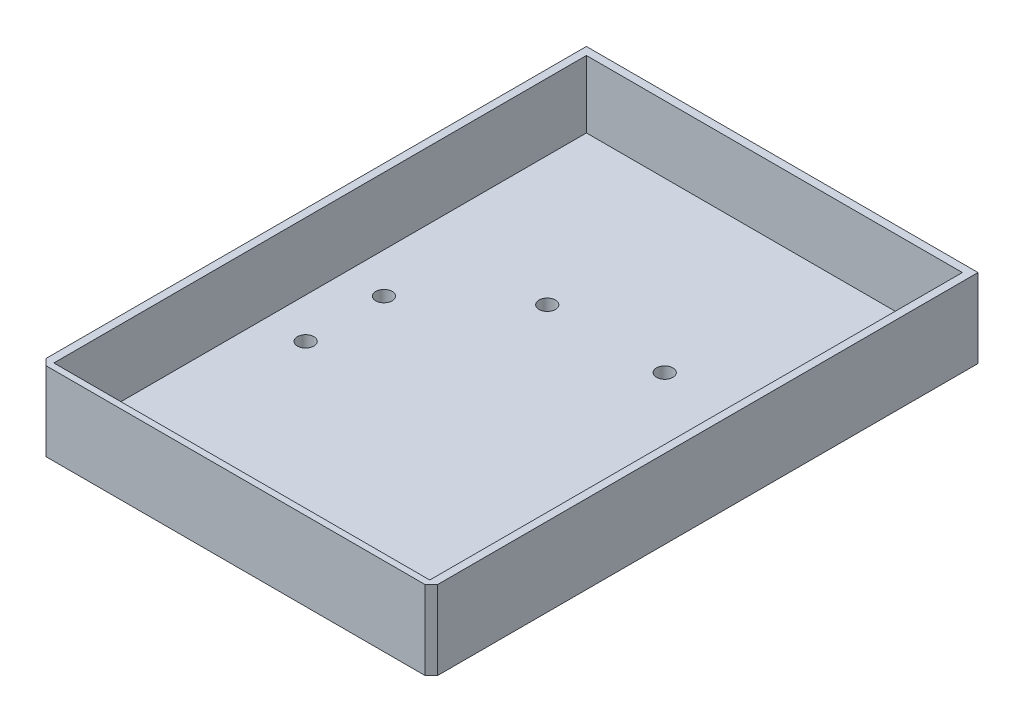
ISO-10303-21;
HEADER;
FILE_DESCRIPTION(('STEP AP214'),'2;1');
FILE_NAME('part.step','',(''),(''),'','','');
FILE_SCHEMA(('AUTOMOTIVE_DESIGN { 1 0 10303 214 1 1 1 1 }'));
ENDSEC;
DATA;
#1=APPLICATION_CONTEXT('core data for automotive mechanical design processes');
#2=APPLICATION_PROTOCOL_DEFINITION('international standard','automotive_design',2000,#1);
#3=PRODUCT_CONTEXT('',#1,'mechanical');
#4=PRODUCT('Part','Part','',(#3));
#5=PRODUCT_RELATED_PRODUCT_CATEGORY('part','',(#4));
#6=PRODUCT_DEFINITION_FORMATION('','',#4);
#7=PRODUCT_DEFINITION_CONTEXT('part definition',#1,'design');
#8=PRODUCT_DEFINITION('design','',#6,#7);
#9=PRODUCT_DEFINITION_SHAPE('','',#8);
#10=(LENGTH_UNIT() NAMED_UNIT(*) SI_UNIT(.MILLI.,.METRE.));
#11=(NAMED_UNIT(*) PLANE_ANGLE_UNIT() SI_UNIT($,.RADIAN.));
#12=(NAMED_UNIT(*) SI_UNIT($,.STERADIAN.) SOLID_ANGLE_UNIT());
#13=UNCERTAINTY_MEASURE_WITH_UNIT(LENGTH_MEASURE(1.E-05),#10,'distance_accuracy_value','');
#14=(GEOMETRIC_REPRESENTATION_CONTEXT(3) GLOBAL_UNCERTAINTY_ASSIGNED_CONTEXT((#13)) GLOBAL_UNIT_ASSIGNED_CONTEXT((#10,
#11,#12)) REPRESENTATION_CONTEXT('',''));
#15=CARTESIAN_POINT('',(0.,0.,0.));
#16=DIRECTION('',(0.,0.,1.));
#17=DIRECTION('',(1.,0.,0.));
#18=AXIS2_PLACEMENT_3D('',#15,#16,#17);
#19=CARTESIAN_POINT('',(-8.55584601503338,3.,163.424821635062));
#20=DIRECTION('',(0.707106781186552,0.,-0.707106781186542));
#21=DIRECTION('',(0.,-1.,0.));
#22=AXIS2_PLACEMENT_3D('',#19,#20,#21);
#23=PLANE('',#22);
#24=DIRECTION('',(0.,-1.,0.));
#25=VECTOR('',#24,1.);
#26=CARTESIAN_POINT('',(-8.95584601503339,3.,163.024821635062));
#27=LINE('',#26,#25);
#28=CARTESIAN_POINT('',(-8.95584601503339,0.,163.024821635062));
#29=VERTEX_POINT('',#28);
#30=CARTESIAN_POINT('',(-8.95584601503339,20.13,163.024821635062));
#31=VERTEX_POINT('',#30);
#32=EDGE_CURVE('E136',#29,#31,#27,.F.);
#33=ORIENTED_EDGE('',*,*,#32,.T.);
#34=DIRECTION('',(0.707106781186543,0.,0.707106781186552));
#35=VECTOR('',#34,1.);
#36=CARTESIAN_POINT('',(-8.55584601503339,20.13,163.424821635062));
#37=LINE('',#36,#35);
#38=CARTESIAN_POINT('',(-10.5558460150334,20.13,161.424821635062));
#39=VERTEX_POINT('',#38);
#40=EDGE_CURVE('E67',#31,#39,#37,.F.);
#41=ORIENTED_EDGE('',*,*,#40,.T.);
#42=DIRECTION('',(0.,1.,0.));
#43=VECTOR('',#42,1.);
#44=CARTESIAN_POINT('',(-10.5558460150334,3.,161.424821635062));
#45=LINE('',#44,#43);
#46=CARTESIAN_POINT('',(-10.5558460150334,0.,161.424821635062));
#47=VERTEX_POINT('',#46);
#48=EDGE_CURVE('E275',#47,#39,#45,.T.);
#49=ORIENTED_EDGE('',*,*,#48,.F.);
#50=DIRECTION('',(0.707106781186543,0.,0.707106781186552));
#51=VECTOR('',#50,1.);
#52=CARTESIAN_POINT('',(-8.55584601503338,0.,163.424821635062));
#53=LINE('',#52,#51);
#54=EDGE_CURVE('E282',#29,#47,#53,.F.);
#55=ORIENTED_EDGE('',*,*,#54,.F.);
#56=EDGE_LOOP('',(#33,#41,#49,#55));
#57=FACE_BOUND('',#56,.T.);
#58=ADVANCED_FACE('F42',(#57),#23,.F.);
#59=CARTESIAN_POINT('',(89.4441539849666,3.,161.424821635062));
#60=DIRECTION('',(-0.707106781186545,0.,-0.70710678118655));
#61=DIRECTION('',(0.,-1.,0.));
#62=AXIS2_PLACEMENT_3D('',#59,#60,#61);
#63=PLANE('',#62);
#64=DIRECTION('',(0.,-1.,0.));
#65=VECTOR('',#64,1.);
#66=CARTESIAN_POINT('',(89.4441539849666,3.,161.424821635062));
#67=LINE('',#66,#65);
#68=CARTESIAN_POINT('',(89.4441539849666,20.13,161.424821635062));
#69=VERTEX_POINT('',#68);
#70=CARTESIAN_POINT('',(89.4441539849666,0.,161.424821635062));
#71=VERTEX_POINT('',#70);
#72=EDGE_CURVE('E52',#69,#71,#67,.T.);
#73=ORIENTED_EDGE('',*,*,#72,.F.);
#74=DIRECTION('',(0.70710678118655,0.,-0.707106781186545));
#75=VECTOR('',#74,1.);
#76=CARTESIAN_POINT('',(89.4441539849666,20.13,161.424821635062));
#77=LINE('',#76,#75);
#78=CARTESIAN_POINT('',(87.8441539849667,20.13,163.024821635062));
#79=VERTEX_POINT('',#78);
#80=EDGE_CURVE('E119',#69,#79,#77,.F.);
#81=ORIENTED_EDGE('',*,*,#80,.T.);
#82=DIRECTION('',(0.,1.,0.));
#83=VECTOR('',#82,1.);
#84=CARTESIAN_POINT('',(87.8441539849667,3.,163.024821635062));
#85=LINE('',#84,#83);
#86=CARTESIAN_POINT('',(87.8441539849667,0.,163.024821635062));
#87=VERTEX_POINT('',#86);
#88=EDGE_CURVE('E127',#79,#87,#85,.F.);
#89=ORIENTED_EDGE('',*,*,#88,.T.);
#90=DIRECTION('',(0.70710678118655,0.,-0.707106781186545));
#91=VECTOR('',#90,1.);
#92=CARTESIAN_POINT('',(89.4441539849666,0.,161.424821635062));
#93=LINE('',#92,#91);
#94=EDGE_CURVE('E279',#71,#87,#93,.F.);
#95=ORIENTED_EDGE('',*,*,#94,.F.);
#96=EDGE_LOOP('',(#73,#81,#89,#95));
#97=FACE_BOUND('',#96,.T.);
#98=ADVANCED_FACE('F45',(#97),#63,.F.);
#99=CARTESIAN_POINT('',(-8.55584601503339,6.,163.424821635062));
#100=DIRECTION('',(-1.,0.,0.));
#101=DIRECTION('',(0.,0.,1.));
#102=AXIS2_PLACEMENT_3D('',#99,#100,#101);
#103=PLANE('',#102);
#104=DIRECTION('',(0.,0.,-1.));
#105=VECTOR('',#104,1.);
#106=CARTESIAN_POINT('',(-8.55584601503339,20.13,163.424821635062));
#107=LINE('',#106,#105);
#108=CARTESIAN_POINT('',(-8.55584601503339,20.13,161.424821635062));
#109=VERTEX_POINT('',#108);
#110=CARTESIAN_POINT('',(-8.55584601503338,20.13,25.4248216350618));
#111=VERTEX_POINT('',#110);
#112=EDGE_CURVE('E59',#109,#111,#107,.T.);
#113=ORIENTED_EDGE('',*,*,#112,.F.);
#114=DIRECTION('',(0.,-1.,0.));
#115=VECTOR('',#114,1.);
#116=CARTESIAN_POINT('',(-8.55584601503338,0.,161.424821635062));
#117=LINE('',#116,#115);
#118=CARTESIAN_POINT('',(-8.55584601503338,3.,161.424821635062));
#119=VERTEX_POINT('',#118);
#120=EDGE_CURVE('E172',#109,#119,#117,.T.);
#121=ORIENTED_EDGE('',*,*,#120,.T.);
#122=DIRECTION('',(0.,0.,-1.));
#123=VECTOR('',#122,1.);
#124=CARTESIAN_POINT('',(-8.55584601503339,3.,163.424821635062));
#125=LINE('',#124,#123);
#126=CARTESIAN_POINT('',(-8.55584601503338,3.,25.4248216350618));
#127=VERTEX_POINT('',#126);
#128=EDGE_CURVE('E179',#119,#127,#125,.T.);
#129=ORIENTED_EDGE('',*,*,#128,.T.);
#130=DIRECTION('',(0.,-1.,0.));
#131=VECTOR('',#130,1.);
#132=CARTESIAN_POINT('',(-8.55584601503338,121.020831073262,25.4248216350618));
#133=LINE('',#132,#131);
#134=EDGE_CURVE('E147',#111,#127,#133,.T.);
#135=ORIENTED_EDGE('',*,*,#134,.F.);
#136=EDGE_LOOP('',(#113,#121,#129,#135));
#137=FACE_BOUND('',#136,.T.);
#138=ADVANCED_FACE('F335',(#137),#103,.F.);
#139=CARTESIAN_POINT('',(87.4441539849667,6.,0.));
#140=DIRECTION('',(-1.,0.,0.));
#141=DIRECTION('',(0.,0.,1.));
#142=AXIS2_PLACEMENT_3D('',#139,#140,#141);
#143=PLANE('',#142);
#144=DIRECTION('',(0.,-1.,0.));
#145=VECTOR('',#144,1.);
#146=CARTESIAN_POINT('',(87.4441539849666,25.,161.424821635062));
#147=LINE('',#146,#145);
#148=CARTESIAN_POINT('',(87.4441539849666,20.13,161.424821635062));
#149=VERTEX_POINT('',#148);
#150=CARTESIAN_POINT('',(87.4441539849666,3.,161.424821635062));
#151=VERTEX_POINT('',#150);
#152=EDGE_CURVE('E161',#149,#151,#147,.T.);
#153=ORIENTED_EDGE('',*,*,#152,.F.);
#154=DIRECTION('',(0.,0.,-1.));
#155=VECTOR('',#154,1.);
#156=CARTESIAN_POINT('',(87.4441539849667,20.13,0.));
#157=LINE('',#156,#155);
#158=CARTESIAN_POINT('',(87.4441539849667,20.13,25.4248216350618));
#159=VERTEX_POINT('',#158);
#160=EDGE_CURVE('E313',#149,#159,#157,.T.);
#161=ORIENTED_EDGE('',*,*,#160,.T.);
#162=DIRECTION('',(0.,-1.,0.));
#163=VECTOR('',#162,1.);
#164=CARTESIAN_POINT('',(87.4441539849667,121.020831073262,25.4248216350618));
#165=LINE('',#164,#163);
#166=CARTESIAN_POINT('',(87.4441539849667,3.,25.4248216350618));
#167=VERTEX_POINT('',#166);
#168=EDGE_CURVE('E152',#159,#167,#165,.T.);
#169=ORIENTED_EDGE('',*,*,#168,.T.);
#170=DIRECTION('',(0.,0.,-1.));
#171=VECTOR('',#170,1.);
#172=CARTESIAN_POINT('',(87.4441539849667,3.,0.));
#173=LINE('',#172,#171);
#174=EDGE_CURVE('E180',#151,#167,#173,.T.);
#175=ORIENTED_EDGE('',*,*,#174,.F.);
#176=EDGE_LOOP('',(#153,#161,#169,#175));
#177=FACE_BOUND('',#176,.T.);
#178=ADVANCED_FACE('F320',(#177),#143,.T.);
#179=CARTESIAN_POINT('',(-8.55584601503339,6.,161.424821635062));
#180=DIRECTION('',(0.,0.,1.));
#181=DIRECTION('',(1.,0.,0.));
#182=AXIS2_PLACEMENT_3D('',#179,#180,#181);
#183=PLANE('',#182);
#184=DIRECTION('',(-1.,0.,0.));
#185=VECTOR('',#184,1.);
#186=CARTESIAN_POINT('',(-8.55584601503339,20.13,161.424821635062));
#187=LINE('',#186,#185);
#188=EDGE_CURVE('E137',#149,#109,#187,.T.);
#189=ORIENTED_EDGE('',*,*,#188,.F.);
#190=ORIENTED_EDGE('',*,*,#152,.T.);
#191=DIRECTION('',(-1.,0.,0.));
#192=VECTOR('',#191,1.);
#193=CARTESIAN_POINT('',(-8.55584601503339,3.,161.424821635062));
#194=LINE('',#193,#192);
#195=EDGE_CURVE('E175',#151,#119,#194,.T.);
#196=ORIENTED_EDGE('',*,*,#195,.T.);
#197=ORIENTED_EDGE('',*,*,#120,.F.);
#198=EDGE_LOOP('',(#189,#190,#196,#197));
#199=FACE_BOUND('',#198,.T.);
#200=ADVANCED_FACE('F333',(#199),#183,.F.);
#201=CARTESIAN_POINT('',(-10.5558460150334,3.,63.4248216350618));
#202=DIRECTION('',(1.,0.,0.));
#203=DIRECTION('',(0.,0.,-1.));
#204=AXIS2_PLACEMENT_3D('',#201,#202,#203);
#205=PLANE('',#204);
#206=DIRECTION('',(0.,0.,1.));
#207=VECTOR('',#206,1.);
#208=CARTESIAN_POINT('',(-10.5558460150334,20.13,63.4248216350618));
#209=LINE('',#208,#207);
#210=CARTESIAN_POINT('',(-10.5558460150334,20.13,23.4248216350618));
#211=VERTEX_POINT('',#210);
#212=EDGE_CURVE('E300',#211,#39,#209,.T.);
#213=ORIENTED_EDGE('',*,*,#212,.F.);
#214=DIRECTION('',(0.,1.,0.));
#215=VECTOR('',#214,1.);
#216=CARTESIAN_POINT('',(-10.5558460150334,25.,23.4248216350618));
#217=LINE('',#216,#215);
#218=CARTESIAN_POINT('',(-10.5558460150334,0.,23.4248216350618));
#219=VERTEX_POINT('',#218);
#220=EDGE_CURVE('E168',#219,#211,#217,.T.);
#221=ORIENTED_EDGE('',*,*,#220,.F.);
#222=DIRECTION('',(0.,0.,1.));
#223=VECTOR('',#222,1.);
#224=CARTESIAN_POINT('',(-10.5558460150334,0.,63.4248216350618));
#225=LINE('',#224,#223);
#226=EDGE_CURVE('E264',#219,#47,#225,.T.);
#227=ORIENTED_EDGE('',*,*,#226,.T.);
#228=ORIENTED_EDGE('',*,*,#48,.T.);
#229=EDGE_LOOP('',(#213,#221,#227,#228));
#230=FACE_BOUND('',#229,.T.);
#231=ADVANCED_FACE('F298',(#230),#205,.F.);
#232=CARTESIAN_POINT('',(89.4441539849666,3.,63.4248216350618));
#233=DIRECTION('',(-1.,0.,0.));
#234=DIRECTION('',(0.,0.,1.));
#235=AXIS2_PLACEMENT_3D('',#232,#233,#234);
#236=PLANE('',#235);
#237=DIRECTION('',(0.,0.,-1.));
#238=VECTOR('',#237,1.);
#239=CARTESIAN_POINT('',(89.4441539849666,20.13,63.4248216350618));
#240=LINE('',#239,#238);
#241=CARTESIAN_POINT('',(89.4441539849666,20.13,23.4248216350618));
#242=VERTEX_POINT('',#241);
#243=EDGE_CURVE('E289',#69,#242,#240,.T.);
#244=ORIENTED_EDGE('',*,*,#243,.F.);
#245=ORIENTED_EDGE('',*,*,#72,.T.);
#246=DIRECTION('',(0.,0.,-1.));
#247=VECTOR('',#246,1.);
#248=CARTESIAN_POINT('',(89.4441539849666,0.,63.4248216350618));
#249=LINE('',#248,#247);
#250=CARTESIAN_POINT('',(89.4441539849666,0.,23.4248216350618));
#251=VERTEX_POINT('',#250);
#252=EDGE_CURVE('E271',#71,#251,#249,.T.);
#253=ORIENTED_EDGE('',*,*,#252,.T.);
#254=DIRECTION('',(0.,1.,0.));
#255=VECTOR('',#254,1.);
#256=CARTESIAN_POINT('',(89.4441539849666,25.,23.4248216350618));
#257=LINE('',#256,#255);
#258=EDGE_CURVE('E157',#251,#242,#257,.T.);
#259=ORIENTED_EDGE('',*,*,#258,.T.);
#260=EDGE_LOOP('',(#244,#245,#253,#259));
#261=FACE_BOUND('',#260,.T.);
#262=ADVANCED_FACE('F286',(#261),#236,.F.);
#263=CARTESIAN_POINT('',(0.,0.,23.4248216350618));
#264=DIRECTION('',(0.,0.,-1.));
#265=DIRECTION('',(-1.,0.,0.));
#266=AXIS2_PLACEMENT_3D('',#263,#264,#265);
#267=PLANE('',#266);
#268=ORIENTED_EDGE('',*,*,#220,.T.);
#269=DIRECTION('',(1.,0.,0.));
#270=VECTOR('',#269,1.);
#271=CARTESIAN_POINT('',(0.,20.13,23.4248216350618));
#272=LINE('',#271,#270);
#273=EDGE_CURVE('E302',#211,#242,#272,.T.);
#274=ORIENTED_EDGE('',*,*,#273,.T.);
#275=ORIENTED_EDGE('',*,*,#258,.F.);
#276=DIRECTION('',(-1.,0.,0.));
#277=VECTOR('',#276,1.);
#278=CARTESIAN_POINT('',(-8.55584601503338,0.,23.4248216350618));
#279=LINE('',#278,#277);
#280=EDGE_CURVE('E164',#251,#219,#279,.T.);
#281=ORIENTED_EDGE('',*,*,#280,.T.);
#282=EDGE_LOOP('',(#268,#274,#275,#281));
#283=FACE_BOUND('',#282,.T.);
#284=ADVANCED_FACE('F294',(#283),#267,.T.);
#285=CARTESIAN_POINT('',(-8.55584601503338,121.020831073262,25.4248216350618));
#286=DIRECTION('',(0.,0.,-1.));
#287=DIRECTION('',(-1.,0.,0.));
#288=AXIS2_PLACEMENT_3D('',#285,#286,#287);
#289=PLANE('',#288);
#290=DIRECTION('',(1.,0.,0.));
#291=VECTOR('',#290,1.);
#292=CARTESIAN_POINT('',(-8.55584601503338,20.13,25.4248216350618));
#293=LINE('',#292,#291);
#294=EDGE_CURVE('E306',#111,#159,#293,.T.);
#295=ORIENTED_EDGE('',*,*,#294,.F.);
#296=ORIENTED_EDGE('',*,*,#134,.T.);
#297=DIRECTION('',(1.,0.,0.));
#298=VECTOR('',#297,1.);
#299=CARTESIAN_POINT('',(-8.55584601503338,3.,25.4248216350618));
#300=LINE('',#299,#298);
#301=EDGE_CURVE('E148',#127,#167,#300,.T.);
#302=ORIENTED_EDGE('',*,*,#301,.T.);
#303=ORIENTED_EDGE('',*,*,#168,.F.);
#304=EDGE_LOOP('',(#295,#296,#302,#303));
#305=FACE_BOUND('',#304,.T.);
#306=ADVANCED_FACE('F324',(#305),#289,.F.);
#307=CARTESIAN_POINT('',(0.,0.,163.024821635062));
#308=DIRECTION('',(0.,0.,1.));
#309=DIRECTION('',(1.,0.,0.));
#310=AXIS2_PLACEMENT_3D('',#307,#308,#309);
#311=PLANE('',#310);
#312=ORIENTED_EDGE('',*,*,#88,.F.);
#313=DIRECTION('',(-1.,0.,0.));
#314=VECTOR('',#313,1.);
#315=CARTESIAN_POINT('',(0.,20.13,163.024821635062));
#316=LINE('',#315,#314);
#317=EDGE_CURVE('E11',#79,#31,#316,.T.);
#318=ORIENTED_EDGE('',*,*,#317,.T.);
#319=ORIENTED_EDGE('',*,*,#32,.F.);
#320=DIRECTION('',(1.,0.,0.));
#321=VECTOR('',#320,1.);
#322=CARTESIAN_POINT('',(0.,0.,163.024821635062));
#323=LINE('',#322,#321);
#324=EDGE_CURVE('E133',#29,#87,#323,.T.);
#325=ORIENTED_EDGE('',*,*,#324,.T.);
#326=EDGE_LOOP('',(#312,#318,#319,#325));
#327=FACE_BOUND('',#326,.T.);
#328=ADVANCED_FACE('F131',(#327),#311,.T.);
#329=CARTESIAN_POINT('',(0.,0.,0.));
#330=DIRECTION('',(0.,1.,0.));
#331=DIRECTION('',(0.,0.,1.));
#332=AXIS2_PLACEMENT_3D('',#329,#330,#331);
#333=PLANE('',#332);
#334=CARTESIAN_POINT('',(54.4441539849665,0.,68.4248216350618));
#335=DIRECTION('',(0.,1.,0.));
#336=DIRECTION('',(0.,0.,-1.));
#337=AXIS2_PLACEMENT_3D('',#334,#335,#336);
#338=CIRCLE('',#337,2.1);
#339=CARTESIAN_POINT('',(54.4441539849665,0.,66.3248216350618));
#340=VERTEX_POINT('',#339);
#341=EDGE_CURVE('E184',#340,#340,#338,.T.);
#342=ORIENTED_EDGE('',*,*,#341,.T.);
#343=EDGE_LOOP('',(#342));
#344=FACE_BOUND('',#343,.T.);
#345=CARTESIAN_POINT('',(77.2035074999913,0.,87.3604147454228));
#346=DIRECTION('',(0.,1.,0.));
#347=DIRECTION('',(0.,0.,-1.));
#348=AXIS2_PLACEMENT_3D('',#345,#346,#347);
#349=CIRCLE('',#348,2.09999999999997);
#350=CARTESIAN_POINT('',(77.2035074999913,0.,85.2604147454228));
#351=VERTEX_POINT('',#350);
#352=EDGE_CURVE('E192',#351,#351,#349,.T.);
#353=ORIENTED_EDGE('',*,*,#352,.T.);
#354=EDGE_LOOP('',(#353));
#355=FACE_BOUND('',#354,.T.);
#356=CARTESIAN_POINT('',(77.2035074999913,0.,107.360414745423));
#357=DIRECTION('',(0.,1.,0.));
#358=DIRECTION('',(0.,0.,-1.));
#359=AXIS2_PLACEMENT_3D('',#356,#357,#358);
#360=CIRCLE('',#359,2.10000000000002);
#361=CARTESIAN_POINT('',(77.2035074999913,0.,105.260414745423));
#362=VERTEX_POINT('',#361);
#363=EDGE_CURVE('E200',#362,#362,#360,.T.);
#364=ORIENTED_EDGE('',*,*,#363,.T.);
#365=EDGE_LOOP('',(#364));
#366=FACE_BOUND('',#365,.T.);
#367=CARTESIAN_POINT('',(77.2035074999913,0.,152.360414745423));
#368=DIRECTION('',(0.,1.,0.));
#369=DIRECTION('',(0.,0.,-1.));
#370=AXIS2_PLACEMENT_3D('',#367,#368,#369);
#371=CIRCLE('',#370,2.09999999999999);
#372=CARTESIAN_POINT('',(77.2035074999913,0.,150.260414745423));
#373=VERTEX_POINT('',#372);
#374=EDGE_CURVE('E208',#373,#373,#371,.T.);
#375=ORIENTED_EDGE('',*,*,#374,.T.);
#376=EDGE_LOOP('',(#375));
#377=FACE_BOUND('',#376,.T.);
#378=CARTESIAN_POINT('',(54.4441539849665,0.,158.424821635062));
#379=DIRECTION('',(0.,1.,0.));
#380=DIRECTION('',(0.,0.,-1.));
#381=AXIS2_PLACEMENT_3D('',#378,#379,#380);
#382=CIRCLE('',#381,2.09999999999999);
#383=CARTESIAN_POINT('',(54.4441539849665,0.,156.324821635062));
#384=VERTEX_POINT('',#383);
#385=EDGE_CURVE('E216',#384,#384,#382,.T.);
#386=ORIENTED_EDGE('',*,*,#385,.T.);
#387=EDGE_LOOP('',(#386));
#388=FACE_BOUND('',#387,.T.);
#389=CARTESIAN_POINT('',(24.4441539849667,0.,68.4248216350618));
#390=DIRECTION('',(0.,1.,0.));
#391=DIRECTION('',(0.,0.,1.));
#392=AXIS2_PLACEMENT_3D('',#389,#390,#391);
#393=CIRCLE('',#392,2.1);
#394=CARTESIAN_POINT('',(24.4441539849667,0.,70.5248216350618));
#395=VERTEX_POINT('',#394);
#396=EDGE_CURVE('E224',#395,#395,#393,.T.);
#397=ORIENTED_EDGE('',*,*,#396,.T.);
#398=EDGE_LOOP('',(#397));
#399=FACE_BOUND('',#398,.T.);
#400=CARTESIAN_POINT('',(24.4441539849667,0.,158.424821635062));
#401=DIRECTION('',(0.,1.,0.));
#402=DIRECTION('',(0.,0.,1.));
#403=AXIS2_PLACEMENT_3D('',#400,#401,#402);
#404=CIRCLE('',#403,2.09999999999999);
#405=CARTESIAN_POINT('',(24.4441539849667,0.,160.524821635062));
#406=VERTEX_POINT('',#405);
#407=EDGE_CURVE('E232',#406,#406,#404,.T.);
#408=ORIENTED_EDGE('',*,*,#407,.T.);
#409=EDGE_LOOP('',(#408));
#410=FACE_BOUND('',#409,.T.);
#411=CARTESIAN_POINT('',(1.68480046994186,0.,152.360414745423));
#412=DIRECTION('',(0.,1.,0.));
#413=DIRECTION('',(0.,0.,1.));
#414=AXIS2_PLACEMENT_3D('',#411,#412,#413);
#415=CIRCLE('',#414,2.1);
#416=CARTESIAN_POINT('',(1.68480046994186,0.,154.460414745423));
#417=VERTEX_POINT('',#416);
#418=EDGE_CURVE('E240',#417,#417,#415,.T.);
#419=ORIENTED_EDGE('',*,*,#418,.T.);
#420=EDGE_LOOP('',(#419));
#421=FACE_BOUND('',#420,.T.);
#422=CARTESIAN_POINT('',(1.68480046994187,0.,107.360414745423));
#423=DIRECTION('',(0.,1.,0.));
#424=DIRECTION('',(0.,0.,1.));
#425=AXIS2_PLACEMENT_3D('',#422,#423,#424);
#426=CIRCLE('',#425,2.10000000000001);
#427=CARTESIAN_POINT('',(1.68480046994187,0.,109.460414745423));
#428=VERTEX_POINT('',#427);
#429=EDGE_CURVE('E248',#428,#428,#426,.T.);
#430=ORIENTED_EDGE('',*,*,#429,.T.);
#431=EDGE_LOOP('',(#430));
#432=FACE_BOUND('',#431,.T.);
#433=CARTESIAN_POINT('',(1.68480046994187,0.,87.3604147454228));
#434=DIRECTION('',(0.,1.,0.));
#435=DIRECTION('',(0.,0.,1.));
#436=AXIS2_PLACEMENT_3D('',#433,#434,#435);
#437=CIRCLE('',#436,2.09999999999998);
#438=CARTESIAN_POINT('',(1.68480046994187,0.,89.4604147454228));
#439=VERTEX_POINT('',#438);
#440=EDGE_CURVE('E256',#439,#439,#437,.T.);
#441=ORIENTED_EDGE('',*,*,#440,.T.);
#442=EDGE_LOOP('',(#441));
#443=FACE_BOUND('',#442,.T.);
#444=ORIENTED_EDGE('',*,*,#324,.F.);
#445=ORIENTED_EDGE('',*,*,#54,.T.);
#446=ORIENTED_EDGE('',*,*,#226,.F.);
#447=ORIENTED_EDGE('',*,*,#280,.F.);
#448=ORIENTED_EDGE('',*,*,#252,.F.);
#449=ORIENTED_EDGE('',*,*,#94,.T.);
#450=EDGE_LOOP('',(#444,#445,#446,#447,#448,#449));
#451=FACE_BOUND('',#450,.T.);
#452=ADVANCED_FACE('F291',(#344,#355,#366,#377,#388,#399,#410,#421,#432,#443,#451),#333,.F.);
#453=CARTESIAN_POINT('',(0.,3.,0.));
#454=DIRECTION('',(0.,1.,0.));
#455=DIRECTION('',(0.,0.,1.));
#456=AXIS2_PLACEMENT_3D('',#453,#454,#455);
#457=PLANE('',#456);
#458=CARTESIAN_POINT('',(24.4441539849667,3.,68.4248216350618));
#459=DIRECTION('',(0.,1.,0.));
#460=DIRECTION('',(0.,0.,1.));
#461=AXIS2_PLACEMENT_3D('',#458,#459,#460);
#462=CIRCLE('',#461,2.1);
#463=CARTESIAN_POINT('',(24.4441539849667,3.,70.5248216350618));
#464=VERTEX_POINT('',#463);
#465=EDGE_CURVE('E228',#464,#464,#462,.T.);
#466=ORIENTED_EDGE('',*,*,#465,.F.);
#467=EDGE_LOOP('',(#466));
#468=FACE_BOUND('',#467,.T.);
#469=CARTESIAN_POINT('',(54.4441539849665,3.,68.4248216350618));
#470=DIRECTION('',(0.,1.,0.));
#471=DIRECTION('',(0.,0.,-1.));
#472=AXIS2_PLACEMENT_3D('',#469,#470,#471);
#473=CIRCLE('',#472,2.1);
#474=CARTESIAN_POINT('',(54.4441539849665,3.,66.3248216350618));
#475=VERTEX_POINT('',#474);
#476=EDGE_CURVE('E188',#475,#475,#473,.T.);
#477=ORIENTED_EDGE('',*,*,#476,.F.);
#478=EDGE_LOOP('',(#477));
#479=FACE_BOUND('',#478,.T.);
#480=CARTESIAN_POINT('',(77.2035074999913,3.,87.3604147454228));
#481=DIRECTION('',(0.,1.,0.));
#482=DIRECTION('',(0.,0.,-1.));
#483=AXIS2_PLACEMENT_3D('',#480,#481,#482);
#484=CIRCLE('',#483,2.09999999999997);
#485=CARTESIAN_POINT('',(77.2035074999913,3.,85.2604147454228));
#486=VERTEX_POINT('',#485);
#487=EDGE_CURVE('E196',#486,#486,#484,.T.);
#488=ORIENTED_EDGE('',*,*,#487,.F.);
#489=EDGE_LOOP('',(#488));
#490=FACE_BOUND('',#489,.T.);
#491=CARTESIAN_POINT('',(77.2035074999913,3.,152.360414745423));
#492=DIRECTION('',(0.,1.,0.));
#493=DIRECTION('',(0.,0.,-1.));
#494=AXIS2_PLACEMENT_3D('',#491,#492,#493);
#495=CIRCLE('',#494,2.09999999999999);
#496=CARTESIAN_POINT('',(77.2035074999913,3.,150.260414745423));
#497=VERTEX_POINT('',#496);
#498=EDGE_CURVE('E212',#497,#497,#495,.T.);
#499=ORIENTED_EDGE('',*,*,#498,.F.);
#500=EDGE_LOOP('',(#499));
#501=FACE_BOUND('',#500,.T.);
#502=CARTESIAN_POINT('',(1.68480046994186,3.,152.360414745423));
#503=DIRECTION('',(0.,1.,0.));
#504=DIRECTION('',(0.,0.,1.));
#505=AXIS2_PLACEMENT_3D('',#502,#503,#504);
#506=CIRCLE('',#505,2.1);
#507=CARTESIAN_POINT('',(1.68480046994186,3.,154.460414745423));
#508=VERTEX_POINT('',#507);
#509=EDGE_CURVE('E244',#508,#508,#506,.T.);
#510=ORIENTED_EDGE('',*,*,#509,.F.);
#511=EDGE_LOOP('',(#510));
#512=FACE_BOUND('',#511,.T.);
#513=CARTESIAN_POINT('',(1.68480046994187,3.,87.3604147454228));
#514=DIRECTION('',(0.,1.,0.));
#515=DIRECTION('',(0.,0.,1.));
#516=AXIS2_PLACEMENT_3D('',#513,#514,#515);
#517=CIRCLE('',#516,2.09999999999998);
#518=CARTESIAN_POINT('',(1.68480046994187,3.,89.4604147454228));
#519=VERTEX_POINT('',#518);
#520=EDGE_CURVE('E260',#519,#519,#517,.T.);
#521=ORIENTED_EDGE('',*,*,#520,.F.);
#522=EDGE_LOOP('',(#521));
#523=FACE_BOUND('',#522,.T.);
#524=CARTESIAN_POINT('',(1.68480046994187,3.,107.360414745423));
#525=DIRECTION('',(0.,1.,0.));
#526=DIRECTION('',(0.,0.,1.));
#527=AXIS2_PLACEMENT_3D('',#524,#525,#526);
#528=CIRCLE('',#527,2.10000000000001);
#529=CARTESIAN_POINT('',(1.68480046994187,3.,109.460414745423));
#530=VERTEX_POINT('',#529);
#531=EDGE_CURVE('E252',#530,#530,#528,.T.);
#532=ORIENTED_EDGE('',*,*,#531,.F.);
#533=EDGE_LOOP('',(#532));
#534=FACE_BOUND('',#533,.T.);
#535=CARTESIAN_POINT('',(24.4441539849667,3.,158.424821635062));
#536=DIRECTION('',(0.,1.,0.));
#537=DIRECTION('',(0.,0.,1.));
#538=AXIS2_PLACEMENT_3D('',#535,#536,#537);
#539=CIRCLE('',#538,2.09999999999999);
#540=CARTESIAN_POINT('',(24.4441539849667,3.,160.524821635062));
#541=VERTEX_POINT('',#540);
#542=EDGE_CURVE('E236',#541,#541,#539,.T.);
#543=ORIENTED_EDGE('',*,*,#542,.F.);
#544=EDGE_LOOP('',(#543));
#545=FACE_BOUND('',#544,.T.);
#546=CARTESIAN_POINT('',(54.4441539849665,3.,158.424821635062));
#547=DIRECTION('',(0.,1.,0.));
#548=DIRECTION('',(0.,0.,-1.));
#549=AXIS2_PLACEMENT_3D('',#546,#547,#548);
#550=CIRCLE('',#549,2.09999999999999);
#551=CARTESIAN_POINT('',(54.4441539849665,3.,156.324821635062));
#552=VERTEX_POINT('',#551);
#553=EDGE_CURVE('E220',#552,#552,#550,.T.);
#554=ORIENTED_EDGE('',*,*,#553,.F.);
#555=EDGE_LOOP('',(#554));
#556=FACE_BOUND('',#555,.T.);
#557=CARTESIAN_POINT('',(77.2035074999913,3.,107.360414745423));
#558=DIRECTION('',(0.,1.,0.));
#559=DIRECTION('',(0.,0.,-1.));
#560=AXIS2_PLACEMENT_3D('',#557,#558,#559);
#561=CIRCLE('',#560,2.10000000000002);
#562=CARTESIAN_POINT('',(77.2035074999913,3.,105.260414745423));
#563=VERTEX_POINT('',#562);
#564=EDGE_CURVE('E204',#563,#563,#561,.T.);
#565=ORIENTED_EDGE('',*,*,#564,.F.);
#566=EDGE_LOOP('',(#565));
#567=FACE_BOUND('',#566,.T.);
#568=ORIENTED_EDGE('',*,*,#174,.T.);
#569=ORIENTED_EDGE('',*,*,#301,.F.);
#570=ORIENTED_EDGE('',*,*,#128,.F.);
#571=ORIENTED_EDGE('',*,*,#195,.F.);
#572=EDGE_LOOP('',(#568,#569,#570,#571));
#573=FACE_BOUND('',#572,.T.);
#574=ADVANCED_FACE('F330',(#468,#479,#490,#501,#512,#523,#534,#545,#556,#567,#573),#457,.T.);
#575=CARTESIAN_POINT('',(1.68480046994187,3.,87.3604147454228));
#576=DIRECTION('',(0.,-1.,0.));
#577=DIRECTION('',(0.,0.,-1.));
#578=AXIS2_PLACEMENT_3D('',#575,#576,#577);
#579=CYLINDRICAL_SURFACE('',#578,2.09999999999998);
#580=ORIENTED_EDGE('',*,*,#520,.T.);
#581=EDGE_LOOP('',(#580));
#582=FACE_BOUND('',#581,.T.);
#583=ORIENTED_EDGE('',*,*,#440,.F.);
#584=EDGE_LOOP('',(#583));
#585=FACE_BOUND('',#584,.T.);
#586=ADVANCED_FACE('F361',(#582,#585),#579,.F.);
#587=CARTESIAN_POINT('',(1.68480046994187,3.,107.360414745423));
#588=DIRECTION('',(0.,-1.,0.));
#589=DIRECTION('',(0.,0.,-1.));
#590=AXIS2_PLACEMENT_3D('',#587,#588,#589);
#591=CYLINDRICAL_SURFACE('',#590,2.10000000000001);
#592=ORIENTED_EDGE('',*,*,#531,.T.);
#593=EDGE_LOOP('',(#592));
#594=FACE_BOUND('',#593,.T.);
#595=ORIENTED_EDGE('',*,*,#429,.F.);
#596=EDGE_LOOP('',(#595));
#597=FACE_BOUND('',#596,.T.);
#598=ADVANCED_FACE('F365',(#594,#597),#591,.F.);
#599=CARTESIAN_POINT('',(1.68480046994186,3.,152.360414745423));
#600=DIRECTION('',(0.,-1.,0.));
#601=DIRECTION('',(0.,0.,-1.));
#602=AXIS2_PLACEMENT_3D('',#599,#600,#601);
#603=CYLINDRICAL_SURFACE('',#602,2.1);
#604=ORIENTED_EDGE('',*,*,#509,.T.);
#605=EDGE_LOOP('',(#604));
#606=FACE_BOUND('',#605,.T.);
#607=ORIENTED_EDGE('',*,*,#418,.F.);
#608=EDGE_LOOP('',(#607));
#609=FACE_BOUND('',#608,.T.);
#610=ADVANCED_FACE('F369',(#606,#609),#603,.F.);
#611=CARTESIAN_POINT('',(24.4441539849667,3.,158.424821635062));
#612=DIRECTION('',(0.,-1.,0.));
#613=DIRECTION('',(0.,0.,-1.));
#614=AXIS2_PLACEMENT_3D('',#611,#612,#613);
#615=CYLINDRICAL_SURFACE('',#614,2.09999999999999);
#616=ORIENTED_EDGE('',*,*,#542,.T.);
#617=EDGE_LOOP('',(#616));
#618=FACE_BOUND('',#617,.T.);
#619=ORIENTED_EDGE('',*,*,#407,.F.);
#620=EDGE_LOOP('',(#619));
#621=FACE_BOUND('',#620,.T.);
#622=ADVANCED_FACE('F373',(#618,#621),#615,.F.);
#623=CARTESIAN_POINT('',(24.4441539849667,3.,68.4248216350618));
#624=DIRECTION('',(0.,-1.,0.));
#625=DIRECTION('',(0.,0.,-1.));
#626=AXIS2_PLACEMENT_3D('',#623,#624,#625);
#627=CYLINDRICAL_SURFACE('',#626,2.1);
#628=ORIENTED_EDGE('',*,*,#465,.T.);
#629=EDGE_LOOP('',(#628));
#630=FACE_BOUND('',#629,.T.);
#631=ORIENTED_EDGE('',*,*,#396,.F.);
#632=EDGE_LOOP('',(#631));
#633=FACE_BOUND('',#632,.T.);
#634=ADVANCED_FACE('F377',(#630,#633),#627,.F.);
#635=CARTESIAN_POINT('',(54.4441539849665,3.,158.424821635062));
#636=DIRECTION('',(0.,-1.,0.));
#637=DIRECTION('',(0.,0.,-1.));
#638=AXIS2_PLACEMENT_3D('',#635,#636,#637);
#639=CYLINDRICAL_SURFACE('',#638,2.09999999999999);
#640=ORIENTED_EDGE('',*,*,#553,.T.);
#641=EDGE_LOOP('',(#640));
#642=FACE_BOUND('',#641,.T.);
#643=ORIENTED_EDGE('',*,*,#385,.F.);
#644=EDGE_LOOP('',(#643));
#645=FACE_BOUND('',#644,.T.);
#646=ADVANCED_FACE('F381',(#642,#645),#639,.F.);
#647=CARTESIAN_POINT('',(77.2035074999913,3.,152.360414745423));
#648=DIRECTION('',(0.,-1.,0.));
#649=DIRECTION('',(0.,0.,-1.));
#650=AXIS2_PLACEMENT_3D('',#647,#648,#649);
#651=CYLINDRICAL_SURFACE('',#650,2.09999999999999);
#652=ORIENTED_EDGE('',*,*,#498,.T.);
#653=EDGE_LOOP('',(#652));
#654=FACE_BOUND('',#653,.T.);
#655=ORIENTED_EDGE('',*,*,#374,.F.);
#656=EDGE_LOOP('',(#655));
#657=FACE_BOUND('',#656,.T.);
#658=ADVANCED_FACE('F385',(#654,#657),#651,.F.);
#659=CARTESIAN_POINT('',(77.2035074999913,3.,107.360414745423));
#660=DIRECTION('',(0.,-1.,0.));
#661=DIRECTION('',(0.,0.,-1.));
#662=AXIS2_PLACEMENT_3D('',#659,#660,#661);
#663=CYLINDRICAL_SURFACE('',#662,2.10000000000002);
#664=ORIENTED_EDGE('',*,*,#564,.T.);
#665=EDGE_LOOP('',(#664));
#666=FACE_BOUND('',#665,.T.);
#667=ORIENTED_EDGE('',*,*,#363,.F.);
#668=EDGE_LOOP('',(#667));
#669=FACE_BOUND('',#668,.T.);
#670=ADVANCED_FACE('F389',(#666,#669),#663,.F.);
#671=CARTESIAN_POINT('',(77.2035074999913,3.,87.3604147454228));
#672=DIRECTION('',(0.,-1.,0.));
#673=DIRECTION('',(0.,0.,-1.));
#674=AXIS2_PLACEMENT_3D('',#671,#672,#673);
#675=CYLINDRICAL_SURFACE('',#674,2.09999999999997);
#676=ORIENTED_EDGE('',*,*,#487,.T.);
#677=EDGE_LOOP('',(#676));
#678=FACE_BOUND('',#677,.T.);
#679=ORIENTED_EDGE('',*,*,#352,.F.);
#680=EDGE_LOOP('',(#679));
#681=FACE_BOUND('',#680,.T.);
#682=ADVANCED_FACE('F393',(#678,#681),#675,.F.);
#683=CARTESIAN_POINT('',(54.4441539849665,3.,68.4248216350618));
#684=DIRECTION('',(0.,-1.,0.));
#685=DIRECTION('',(0.,0.,-1.));
#686=AXIS2_PLACEMENT_3D('',#683,#684,#685);
#687=CYLINDRICAL_SURFACE('',#686,2.1);
#688=ORIENTED_EDGE('',*,*,#476,.T.);
#689=EDGE_LOOP('',(#688));
#690=FACE_BOUND('',#689,.T.);
#691=ORIENTED_EDGE('',*,*,#341,.F.);
#692=EDGE_LOOP('',(#691));
#693=FACE_BOUND('',#692,.T.);
#694=ADVANCED_FACE('F396',(#690,#693),#687,.F.);
#695=CARTESIAN_POINT('',(0.,20.13,0.));
#696=DIRECTION('',(0.,1.,0.));
#697=DIRECTION('',(0.,0.,1.));
#698=AXIS2_PLACEMENT_3D('',#695,#696,#697);
#699=PLANE('',#698);
#700=ORIENTED_EDGE('',*,*,#212,.T.);
#701=ORIENTED_EDGE('',*,*,#40,.F.);
#702=ORIENTED_EDGE('',*,*,#317,.F.);
#703=ORIENTED_EDGE('',*,*,#80,.F.);
#704=ORIENTED_EDGE('',*,*,#243,.T.);
#705=ORIENTED_EDGE('',*,*,#273,.F.);
#706=EDGE_LOOP('',(#700,#701,#702,#703,#704,#705));
#707=FACE_BOUND('',#706,.T.);
#708=ORIENTED_EDGE('',*,*,#188,.T.);
#709=ORIENTED_EDGE('',*,*,#112,.T.);
#710=ORIENTED_EDGE('',*,*,#294,.T.);
#711=ORIENTED_EDGE('',*,*,#160,.F.);
#712=EDGE_LOOP('',(#708,#709,#710,#711));
#713=FACE_BOUND('',#712,.T.);
#714=ADVANCED_FACE('F118',(#707,#713),#699,.T.);
#715=CLOSED_SHELL('',(#58,#98,#138,#178,#200,#231,#262,#284,#306,#328,#452,#574,#586,#598,#610,
#622,#634,#646,#658,#670,#682,#694,#714));
#716=MANIFOLD_SOLID_BREP('B2',#715);
#717=ADVANCED_BREP_SHAPE_REPRESENTATION('',(#18,#716),#14);
#718=SHAPE_DEFINITION_REPRESENTATION(#9,#717);
ENDSEC;
END-ISO-10303-21;
